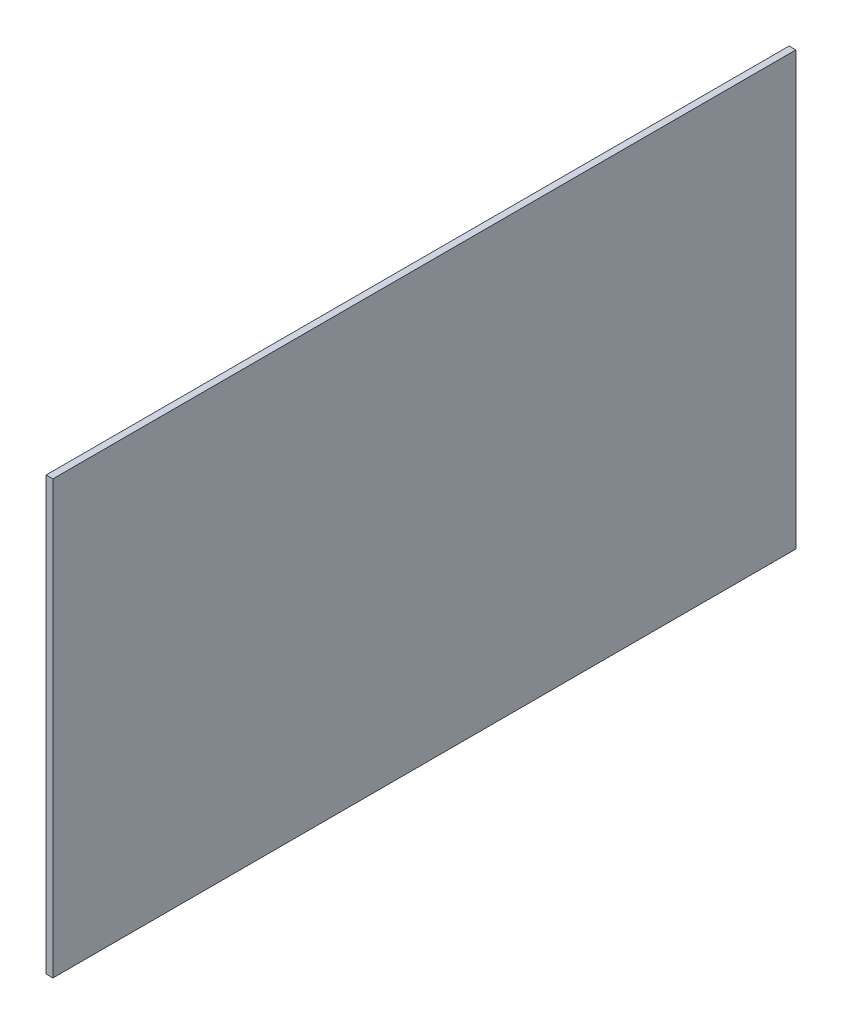
ISO-10303-21;
HEADER;
FILE_DESCRIPTION(('STEP AP214'),'2;1');
FILE_NAME('part.step','',(''),(''),'','','');
FILE_SCHEMA(('AUTOMOTIVE_DESIGN { 1 0 10303 214 1 1 1 1 }'));
ENDSEC;
DATA;
#1=APPLICATION_CONTEXT('core data for automotive mechanical design processes');
#2=APPLICATION_PROTOCOL_DEFINITION('international standard','automotive_design',2000,#1);
#3=PRODUCT_CONTEXT('',#1,'mechanical');
#4=PRODUCT('Part','Part','',(#3));
#5=PRODUCT_RELATED_PRODUCT_CATEGORY('part','',(#4));
#6=PRODUCT_DEFINITION_FORMATION('','',#4);
#7=PRODUCT_DEFINITION_CONTEXT('part definition',#1,'design');
#8=PRODUCT_DEFINITION('design','',#6,#7);
#9=PRODUCT_DEFINITION_SHAPE('','',#8);
#10=(LENGTH_UNIT() NAMED_UNIT(*) SI_UNIT(.MILLI.,.METRE.));
#11=(NAMED_UNIT(*) PLANE_ANGLE_UNIT() SI_UNIT($,.RADIAN.));
#12=(NAMED_UNIT(*) SI_UNIT($,.STERADIAN.) SOLID_ANGLE_UNIT());
#13=UNCERTAINTY_MEASURE_WITH_UNIT(LENGTH_MEASURE(1.E-05),#10,'distance_accuracy_value','');
#14=(GEOMETRIC_REPRESENTATION_CONTEXT(3) GLOBAL_UNCERTAINTY_ASSIGNED_CONTEXT((#13)) GLOBAL_UNIT_ASSIGNED_CONTEXT((#10,
#11,#12)) REPRESENTATION_CONTEXT('',''));
#15=CARTESIAN_POINT('',(0.,0.,0.));
#16=DIRECTION('',(0.,0.,1.));
#17=DIRECTION('',(1.,0.,0.));
#18=AXIS2_PLACEMENT_3D('',#15,#16,#17);
#19=CARTESIAN_POINT('',(6.35,-203.2,349.25));
#20=DIRECTION('',(0.,0.,-1.));
#21=DIRECTION('',(-1.,0.,0.));
#22=AXIS2_PLACEMENT_3D('',#19,#20,#21);
#23=PLANE('',#22);
#24=DIRECTION('',(0.,-1.,0.));
#25=VECTOR('',#24,1.);
#26=CARTESIAN_POINT('',(0.,-203.2,349.25));
#27=LINE('',#26,#25);
#28=CARTESIAN_POINT('',(0.,203.2,349.25));
#29=VERTEX_POINT('',#28);
#30=CARTESIAN_POINT('',(0.,-203.2,349.25));
#31=VERTEX_POINT('',#30);
#32=EDGE_CURVE('E95',#29,#31,#27,.T.);
#33=ORIENTED_EDGE('',*,*,#32,.T.);
#34=DIRECTION('',(-1.,0.,0.));
#35=VECTOR('',#34,1.);
#36=CARTESIAN_POINT('',(6.35,-203.2,349.25));
#37=LINE('',#36,#35);
#38=CARTESIAN_POINT('',(6.35,-203.2,349.25));
#39=VERTEX_POINT('',#38);
#40=EDGE_CURVE('E11',#39,#31,#37,.T.);
#41=ORIENTED_EDGE('',*,*,#40,.F.);
#42=DIRECTION('',(0.,-1.,0.));
#43=VECTOR('',#42,1.);
#44=CARTESIAN_POINT('',(6.35,-203.2,349.25));
#45=LINE('',#44,#43);
#46=CARTESIAN_POINT('',(6.35,203.2,349.25));
#47=VERTEX_POINT('',#46);
#48=EDGE_CURVE('E83',#47,#39,#45,.T.);
#49=ORIENTED_EDGE('',*,*,#48,.F.);
#50=DIRECTION('',(-1.,0.,0.));
#51=VECTOR('',#50,1.);
#52=CARTESIAN_POINT('',(6.35,203.2,349.25));
#53=LINE('',#52,#51);
#54=EDGE_CURVE('E91',#47,#29,#53,.T.);
#55=ORIENTED_EDGE('',*,*,#54,.T.);
#56=EDGE_LOOP('',(#33,#41,#49,#55));
#57=FACE_BOUND('',#56,.T.);
#58=ADVANCED_FACE('F32',(#57),#23,.F.);
#59=CARTESIAN_POINT('',(6.35,-203.2,-349.25));
#60=DIRECTION('',(0.,1.,0.));
#61=DIRECTION('',(0.,0.,1.));
#62=AXIS2_PLACEMENT_3D('',#59,#60,#61);
#63=PLANE('',#62);
#64=DIRECTION('',(0.,0.,-1.));
#65=VECTOR('',#64,1.);
#66=CARTESIAN_POINT('',(0.,-203.2,-349.25));
#67=LINE('',#66,#65);
#68=CARTESIAN_POINT('',(0.,-203.2,-349.25));
#69=VERTEX_POINT('',#68);
#70=EDGE_CURVE('E87',#31,#69,#67,.T.);
#71=ORIENTED_EDGE('',*,*,#70,.T.);
#72=DIRECTION('',(-1.,0.,0.));
#73=VECTOR('',#72,1.);
#74=CARTESIAN_POINT('',(6.35,-203.2,-349.25));
#75=LINE('',#74,#73);
#76=CARTESIAN_POINT('',(6.35,-203.2,-349.25));
#77=VERTEX_POINT('',#76);
#78=EDGE_CURVE('E40',#77,#69,#75,.T.);
#79=ORIENTED_EDGE('',*,*,#78,.F.);
#80=DIRECTION('',(0.,0.,-1.));
#81=VECTOR('',#80,1.);
#82=CARTESIAN_POINT('',(6.35,-203.2,-349.25));
#83=LINE('',#82,#81);
#84=EDGE_CURVE('E78',#39,#77,#83,.T.);
#85=ORIENTED_EDGE('',*,*,#84,.F.);
#86=ORIENTED_EDGE('',*,*,#40,.T.);
#87=EDGE_LOOP('',(#71,#79,#85,#86));
#88=FACE_BOUND('',#87,.T.);
#89=ADVANCED_FACE('F86',(#88),#63,.F.);
#90=CARTESIAN_POINT('',(6.35,-203.2,-349.25));
#91=DIRECTION('',(0.,0.,1.));
#92=DIRECTION('',(1.,0.,0.));
#93=AXIS2_PLACEMENT_3D('',#90,#91,#92);
#94=PLANE('',#93);
#95=DIRECTION('',(0.,1.,0.));
#96=VECTOR('',#95,1.);
#97=CARTESIAN_POINT('',(0.,-203.2,-349.25));
#98=LINE('',#97,#96);
#99=CARTESIAN_POINT('',(0.,203.2,-349.25));
#100=VERTEX_POINT('',#99);
#101=EDGE_CURVE('E65',#69,#100,#98,.T.);
#102=ORIENTED_EDGE('',*,*,#101,.T.);
#103=DIRECTION('',(-1.,0.,0.));
#104=VECTOR('',#103,1.);
#105=CARTESIAN_POINT('',(6.35,203.2,-349.25));
#106=LINE('',#105,#104);
#107=CARTESIAN_POINT('',(6.35,203.2,-349.25));
#108=VERTEX_POINT('',#107);
#109=EDGE_CURVE('E88',#108,#100,#106,.T.);
#110=ORIENTED_EDGE('',*,*,#109,.F.);
#111=DIRECTION('',(0.,1.,0.));
#112=VECTOR('',#111,1.);
#113=CARTESIAN_POINT('',(6.35,-203.2,-349.25));
#114=LINE('',#113,#112);
#115=EDGE_CURVE('E81',#77,#108,#114,.T.);
#116=ORIENTED_EDGE('',*,*,#115,.F.);
#117=ORIENTED_EDGE('',*,*,#78,.T.);
#118=EDGE_LOOP('',(#102,#110,#116,#117));
#119=FACE_BOUND('',#118,.T.);
#120=ADVANCED_FACE('F89',(#119),#94,.F.);
#121=CARTESIAN_POINT('',(6.35,203.2,-349.25));
#122=DIRECTION('',(0.,-1.,0.));
#123=DIRECTION('',(0.,0.,-1.));
#124=AXIS2_PLACEMENT_3D('',#121,#122,#123);
#125=PLANE('',#124);
#126=DIRECTION('',(0.,0.,1.));
#127=VECTOR('',#126,1.);
#128=CARTESIAN_POINT('',(0.,203.2,-349.25));
#129=LINE('',#128,#127);
#130=EDGE_CURVE('E71',#100,#29,#129,.T.);
#131=ORIENTED_EDGE('',*,*,#130,.T.);
#132=ORIENTED_EDGE('',*,*,#54,.F.);
#133=DIRECTION('',(0.,0.,1.));
#134=VECTOR('',#133,1.);
#135=CARTESIAN_POINT('',(6.35,203.2,-349.25));
#136=LINE('',#135,#134);
#137=EDGE_CURVE('E48',#108,#47,#136,.T.);
#138=ORIENTED_EDGE('',*,*,#137,.F.);
#139=ORIENTED_EDGE('',*,*,#109,.T.);
#140=EDGE_LOOP('',(#131,#132,#138,#139));
#141=FACE_BOUND('',#140,.T.);
#142=ADVANCED_FACE('F102',(#141),#125,.F.);
#143=CARTESIAN_POINT('',(6.35,0.,0.));
#144=DIRECTION('',(1.,0.,0.));
#145=DIRECTION('',(0.,0.,-1.));
#146=AXIS2_PLACEMENT_3D('',#143,#144,#145);
#147=PLANE('',#146);
#148=ORIENTED_EDGE('',*,*,#48,.T.);
#149=ORIENTED_EDGE('',*,*,#84,.T.);
#150=ORIENTED_EDGE('',*,*,#115,.T.);
#151=ORIENTED_EDGE('',*,*,#137,.T.);
#152=EDGE_LOOP('',(#148,#149,#150,#151));
#153=FACE_BOUND('',#152,.T.);
#154=ADVANCED_FACE('F79',(#153),#147,.T.);
#155=CARTESIAN_POINT('',(0.,0.,0.));
#156=DIRECTION('',(1.,0.,0.));
#157=DIRECTION('',(0.,0.,-1.));
#158=AXIS2_PLACEMENT_3D('',#155,#156,#157);
#159=PLANE('',#158);
#160=ORIENTED_EDGE('',*,*,#32,.F.);
#161=ORIENTED_EDGE('',*,*,#130,.F.);
#162=ORIENTED_EDGE('',*,*,#101,.F.);
#163=ORIENTED_EDGE('',*,*,#70,.F.);
#164=EDGE_LOOP('',(#160,#161,#162,#163));
#165=FACE_BOUND('',#164,.T.);
#166=ADVANCED_FACE('F105',(#165),#159,.F.);
#167=CLOSED_SHELL('',(#58,#89,#120,#142,#154,#166));
#168=MANIFOLD_SOLID_BREP('B2',#167);
#169=ADVANCED_BREP_SHAPE_REPRESENTATION('',(#18,#168),#14);
#170=SHAPE_DEFINITION_REPRESENTATION(#9,#169);
ENDSEC;
END-ISO-10303-21;
